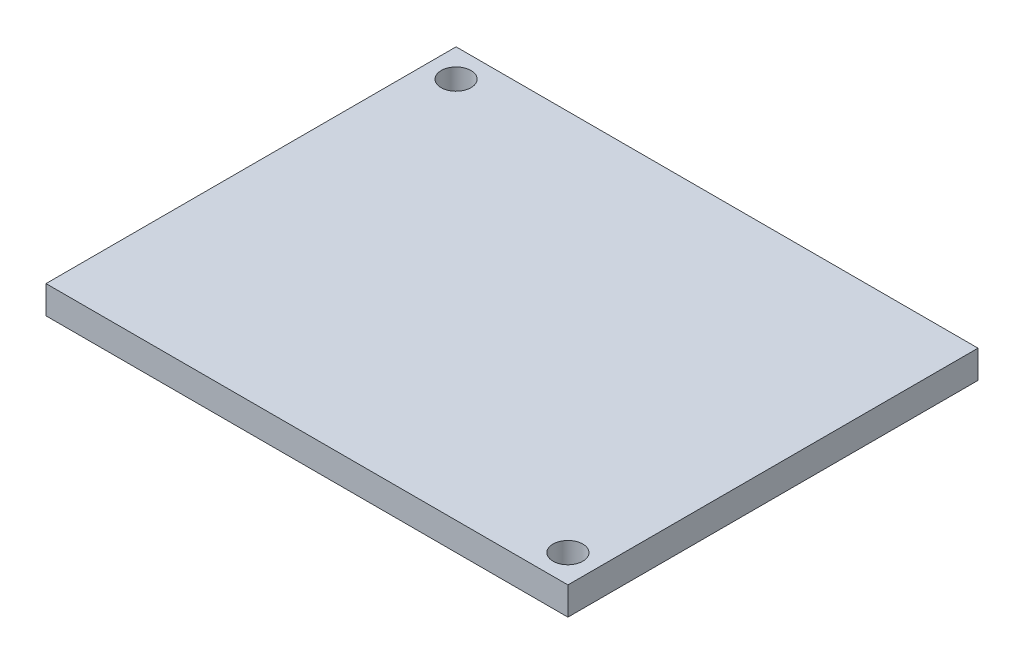
ISO-10303-21;
HEADER;
FILE_DESCRIPTION(('STEP AP214'),'2;1');
FILE_NAME('part.step','',(''),(''),'','','');
FILE_SCHEMA(('AUTOMOTIVE_DESIGN { 1 0 10303 214 1 1 1 1 }'));
ENDSEC;
DATA;
#1=APPLICATION_CONTEXT('core data for automotive mechanical design processes');
#2=APPLICATION_PROTOCOL_DEFINITION('international standard','automotive_design',2000,#1);
#3=PRODUCT_CONTEXT('',#1,'mechanical');
#4=PRODUCT('Part','Part','',(#3));
#5=PRODUCT_RELATED_PRODUCT_CATEGORY('part','',(#4));
#6=PRODUCT_DEFINITION_FORMATION('','',#4);
#7=PRODUCT_DEFINITION_CONTEXT('part definition',#1,'design');
#8=PRODUCT_DEFINITION('design','',#6,#7);
#9=PRODUCT_DEFINITION_SHAPE('','',#8);
#10=(LENGTH_UNIT() NAMED_UNIT(*) SI_UNIT(.MILLI.,.METRE.));
#11=(NAMED_UNIT(*) PLANE_ANGLE_UNIT() SI_UNIT($,.RADIAN.));
#12=(NAMED_UNIT(*) SI_UNIT($,.STERADIAN.) SOLID_ANGLE_UNIT());
#13=UNCERTAINTY_MEASURE_WITH_UNIT(LENGTH_MEASURE(1.E-05),#10,'distance_accuracy_value','');
#14=(GEOMETRIC_REPRESENTATION_CONTEXT(3) GLOBAL_UNCERTAINTY_ASSIGNED_CONTEXT((#13)) GLOBAL_UNIT_ASSIGNED_CONTEXT((#10,
#11,#12)) REPRESENTATION_CONTEXT('',''));
#15=CARTESIAN_POINT('',(0.,0.,0.));
#16=DIRECTION('',(0.,0.,1.));
#17=DIRECTION('',(1.,0.,0.));
#18=AXIS2_PLACEMENT_3D('',#15,#16,#17);
#19=CARTESIAN_POINT('',(-535.449567723343,3.,-356.295389048991));
#20=DIRECTION('',(1.,0.,0.));
#21=DIRECTION('',(0.,0.,-1.));
#22=AXIS2_PLACEMENT_3D('',#19,#20,#21);
#23=PLANE('',#22);
#24=DIRECTION('',(0.,0.,1.));
#25=VECTOR('',#24,1.);
#26=CARTESIAN_POINT('',(-535.449567723343,0.,-356.295389048991));
#27=LINE('',#26,#25);
#28=CARTESIAN_POINT('',(-535.449567723343,0.,-356.295389048991));
#29=VERTEX_POINT('',#28);
#30=CARTESIAN_POINT('',(-535.449567723343,0.,-312.295389048991));
#31=VERTEX_POINT('',#30);
#32=EDGE_CURVE('E96',#29,#31,#27,.T.);
#33=ORIENTED_EDGE('',*,*,#32,.T.);
#34=DIRECTION('',(0.,-1.,0.));
#35=VECTOR('',#34,1.);
#36=CARTESIAN_POINT('',(-535.449567723343,3.,-312.295389048991));
#37=LINE('',#36,#35);
#38=CARTESIAN_POINT('',(-535.449567723343,3.,-312.295389048991));
#39=VERTEX_POINT('',#38);
#40=EDGE_CURVE('E11',#39,#31,#37,.T.);
#41=ORIENTED_EDGE('',*,*,#40,.F.);
#42=DIRECTION('',(0.,0.,1.));
#43=VECTOR('',#42,1.);
#44=CARTESIAN_POINT('',(-535.449567723343,3.,-356.295389048991));
#45=LINE('',#44,#43);
#46=CARTESIAN_POINT('',(-535.449567723343,3.,-356.295389048991));
#47=VERTEX_POINT('',#46);
#48=EDGE_CURVE('E84',#47,#39,#45,.T.);
#49=ORIENTED_EDGE('',*,*,#48,.F.);
#50=DIRECTION('',(0.,-1.,0.));
#51=VECTOR('',#50,1.);
#52=CARTESIAN_POINT('',(-535.449567723343,3.,-356.295389048991));
#53=LINE('',#52,#51);
#54=EDGE_CURVE('E92',#47,#29,#53,.T.);
#55=ORIENTED_EDGE('',*,*,#54,.T.);
#56=EDGE_LOOP('',(#33,#41,#49,#55));
#57=FACE_BOUND('',#56,.T.);
#58=ADVANCED_FACE('F33',(#57),#23,.F.);
#59=CARTESIAN_POINT('',(-535.449567723343,3.,-312.295389048991));
#60=DIRECTION('',(0.,0.,-1.));
#61=DIRECTION('',(-1.,0.,0.));
#62=AXIS2_PLACEMENT_3D('',#59,#60,#61);
#63=PLANE('',#62);
#64=DIRECTION('',(1.,0.,0.));
#65=VECTOR('',#64,1.);
#66=CARTESIAN_POINT('',(-535.449567723343,0.,-312.295389048991));
#67=LINE('',#66,#65);
#68=CARTESIAN_POINT('',(-479.449567723343,0.,-312.295389048991));
#69=VERTEX_POINT('',#68);
#70=EDGE_CURVE('E88',#31,#69,#67,.T.);
#71=ORIENTED_EDGE('',*,*,#70,.T.);
#72=DIRECTION('',(0.,-1.,0.));
#73=VECTOR('',#72,1.);
#74=CARTESIAN_POINT('',(-479.449567723343,3.,-312.295389048991));
#75=LINE('',#74,#73);
#76=CARTESIAN_POINT('',(-479.449567723343,3.,-312.295389048991));
#77=VERTEX_POINT('',#76);
#78=EDGE_CURVE('E41',#77,#69,#75,.T.);
#79=ORIENTED_EDGE('',*,*,#78,.F.);
#80=DIRECTION('',(1.,0.,0.));
#81=VECTOR('',#80,1.);
#82=CARTESIAN_POINT('',(-535.449567723343,3.,-312.295389048991));
#83=LINE('',#82,#81);
#84=EDGE_CURVE('E79',#39,#77,#83,.T.);
#85=ORIENTED_EDGE('',*,*,#84,.F.);
#86=ORIENTED_EDGE('',*,*,#40,.T.);
#87=EDGE_LOOP('',(#71,#79,#85,#86));
#88=FACE_BOUND('',#87,.T.);
#89=ADVANCED_FACE('F87',(#88),#63,.F.);
#90=CARTESIAN_POINT('',(-479.449567723343,3.,-356.295389048991));
#91=DIRECTION('',(-1.,0.,0.));
#92=DIRECTION('',(0.,0.,1.));
#93=AXIS2_PLACEMENT_3D('',#90,#91,#92);
#94=PLANE('',#93);
#95=DIRECTION('',(0.,0.,-1.));
#96=VECTOR('',#95,1.);
#97=CARTESIAN_POINT('',(-479.449567723343,0.,-356.295389048991));
#98=LINE('',#97,#96);
#99=CARTESIAN_POINT('',(-479.449567723343,0.,-356.295389048991));
#100=VERTEX_POINT('',#99);
#101=EDGE_CURVE('E66',#69,#100,#98,.T.);
#102=ORIENTED_EDGE('',*,*,#101,.T.);
#103=DIRECTION('',(0.,-1.,0.));
#104=VECTOR('',#103,1.);
#105=CARTESIAN_POINT('',(-479.449567723343,3.,-356.295389048991));
#106=LINE('',#105,#104);
#107=CARTESIAN_POINT('',(-479.449567723343,3.,-356.295389048991));
#108=VERTEX_POINT('',#107);
#109=EDGE_CURVE('E89',#108,#100,#106,.T.);
#110=ORIENTED_EDGE('',*,*,#109,.F.);
#111=DIRECTION('',(0.,0.,-1.));
#112=VECTOR('',#111,1.);
#113=CARTESIAN_POINT('',(-479.449567723343,3.,-356.295389048991));
#114=LINE('',#113,#112);
#115=EDGE_CURVE('E82',#77,#108,#114,.T.);
#116=ORIENTED_EDGE('',*,*,#115,.F.);
#117=ORIENTED_EDGE('',*,*,#78,.T.);
#118=EDGE_LOOP('',(#102,#110,#116,#117));
#119=FACE_BOUND('',#118,.T.);
#120=ADVANCED_FACE('F90',(#119),#94,.F.);
#121=CARTESIAN_POINT('',(-535.449567723343,3.,-356.295389048991));
#122=DIRECTION('',(0.,0.,1.));
#123=DIRECTION('',(1.,0.,0.));
#124=AXIS2_PLACEMENT_3D('',#121,#122,#123);
#125=PLANE('',#124);
#126=DIRECTION('',(-1.,0.,0.));
#127=VECTOR('',#126,1.);
#128=CARTESIAN_POINT('',(-535.449567723343,0.,-356.295389048991));
#129=LINE('',#128,#127);
#130=EDGE_CURVE('E72',#100,#29,#129,.T.);
#131=ORIENTED_EDGE('',*,*,#130,.T.);
#132=ORIENTED_EDGE('',*,*,#54,.F.);
#133=DIRECTION('',(-1.,0.,0.));
#134=VECTOR('',#133,1.);
#135=CARTESIAN_POINT('',(-535.449567723343,3.,-356.295389048991));
#136=LINE('',#135,#134);
#137=EDGE_CURVE('E49',#108,#47,#136,.T.);
#138=ORIENTED_EDGE('',*,*,#137,.F.);
#139=ORIENTED_EDGE('',*,*,#109,.T.);
#140=EDGE_LOOP('',(#131,#132,#138,#139));
#141=FACE_BOUND('',#140,.T.);
#142=ADVANCED_FACE('F104',(#141),#125,.F.);
#143=CARTESIAN_POINT('',(0.,3.,0.));
#144=DIRECTION('',(0.,1.,0.));
#145=DIRECTION('',(0.,0.,1.));
#146=AXIS2_PLACEMENT_3D('',#143,#144,#145);
#147=PLANE('',#146);
#148=CARTESIAN_POINT('',(-482.449567723343,3.,-315.295389048991));
#149=DIRECTION('',(0.,1.,0.));
#150=DIRECTION('',(0.,0.,1.));
#151=AXIS2_PLACEMENT_3D('',#148,#149,#150);
#152=CIRCLE('',#151,1.59999999999996);
#153=CARTESIAN_POINT('',(-482.449567723343,3.,-313.695389048991));
#154=VERTEX_POINT('',#153);
#155=EDGE_CURVE('E116',#154,#154,#152,.T.);
#156=ORIENTED_EDGE('',*,*,#155,.F.);
#157=EDGE_LOOP('',(#156));
#158=FACE_BOUND('',#157,.T.);
#159=CARTESIAN_POINT('',(-532.449567723343,3.,-353.295389048991));
#160=DIRECTION('',(0.,1.,0.));
#161=DIRECTION('',(0.,0.,1.));
#162=AXIS2_PLACEMENT_3D('',#159,#160,#161);
#163=CIRCLE('',#162,1.60000000000002);
#164=CARTESIAN_POINT('',(-532.449567723343,3.,-351.695389048991));
#165=VERTEX_POINT('',#164);
#166=EDGE_CURVE('E110',#165,#165,#163,.T.);
#167=ORIENTED_EDGE('',*,*,#166,.F.);
#168=EDGE_LOOP('',(#167));
#169=FACE_BOUND('',#168,.T.);
#170=ORIENTED_EDGE('',*,*,#48,.T.);
#171=ORIENTED_EDGE('',*,*,#84,.T.);
#172=ORIENTED_EDGE('',*,*,#115,.T.);
#173=ORIENTED_EDGE('',*,*,#137,.T.);
#174=EDGE_LOOP('',(#170,#171,#172,#173));
#175=FACE_BOUND('',#174,.T.);
#176=ADVANCED_FACE('F80',(#158,#169,#175),#147,.T.);
#177=CARTESIAN_POINT('',(0.,0.,0.));
#178=DIRECTION('',(0.,1.,0.));
#179=DIRECTION('',(0.,0.,1.));
#180=AXIS2_PLACEMENT_3D('',#177,#178,#179);
#181=PLANE('',#180);
#182=CARTESIAN_POINT('',(-482.449567723343,0.,-315.295389048991));
#183=DIRECTION('',(0.,1.,0.));
#184=DIRECTION('',(0.,0.,1.));
#185=AXIS2_PLACEMENT_3D('',#182,#183,#184);
#186=CIRCLE('',#185,1.59999999999996);
#187=CARTESIAN_POINT('',(-482.449567723343,0.,-313.695389048991));
#188=VERTEX_POINT('',#187);
#189=EDGE_CURVE('E113',#188,#188,#186,.T.);
#190=ORIENTED_EDGE('',*,*,#189,.T.);
#191=EDGE_LOOP('',(#190));
#192=FACE_BOUND('',#191,.T.);
#193=CARTESIAN_POINT('',(-532.449567723343,0.,-353.295389048991));
#194=DIRECTION('',(0.,1.,0.));
#195=DIRECTION('',(0.,0.,1.));
#196=AXIS2_PLACEMENT_3D('',#193,#194,#195);
#197=CIRCLE('',#196,1.60000000000002);
#198=CARTESIAN_POINT('',(-532.449567723343,0.,-351.695389048991));
#199=VERTEX_POINT('',#198);
#200=EDGE_CURVE('E99',#199,#199,#197,.T.);
#201=ORIENTED_EDGE('',*,*,#200,.T.);
#202=EDGE_LOOP('',(#201));
#203=FACE_BOUND('',#202,.T.);
#204=ORIENTED_EDGE('',*,*,#32,.F.);
#205=ORIENTED_EDGE('',*,*,#130,.F.);
#206=ORIENTED_EDGE('',*,*,#101,.F.);
#207=ORIENTED_EDGE('',*,*,#70,.F.);
#208=EDGE_LOOP('',(#204,#205,#206,#207));
#209=FACE_BOUND('',#208,.T.);
#210=ADVANCED_FACE('F107',(#192,#203,#209),#181,.F.);
#211=CARTESIAN_POINT('',(-532.449567723343,0.,-353.295389048991));
#212=DIRECTION('',(0.,1.,0.));
#213=DIRECTION('',(0.,0.,1.));
#214=AXIS2_PLACEMENT_3D('',#211,#212,#213);
#215=CYLINDRICAL_SURFACE('',#214,1.60000000000002);
#216=ORIENTED_EDGE('',*,*,#200,.F.);
#217=EDGE_LOOP('',(#216));
#218=FACE_BOUND('',#217,.T.);
#219=ORIENTED_EDGE('',*,*,#166,.T.);
#220=EDGE_LOOP('',(#219));
#221=FACE_BOUND('',#220,.T.);
#222=ADVANCED_FACE('F127',(#218,#221),#215,.F.);
#223=CARTESIAN_POINT('',(-482.449567723343,0.,-315.295389048991));
#224=DIRECTION('',(0.,1.,0.));
#225=DIRECTION('',(0.,0.,1.));
#226=AXIS2_PLACEMENT_3D('',#223,#224,#225);
#227=CYLINDRICAL_SURFACE('',#226,1.59999999999996);
#228=ORIENTED_EDGE('',*,*,#189,.F.);
#229=EDGE_LOOP('',(#228));
#230=FACE_BOUND('',#229,.T.);
#231=ORIENTED_EDGE('',*,*,#155,.T.);
#232=EDGE_LOOP('',(#231));
#233=FACE_BOUND('',#232,.T.);
#234=ADVANCED_FACE('F124',(#230,#233),#227,.F.);
#235=CLOSED_SHELL('',(#58,#89,#120,#142,#176,#210,#222,#234));
#236=MANIFOLD_SOLID_BREP('B2',#235);
#237=ADVANCED_BREP_SHAPE_REPRESENTATION('',(#18,#236),#14);
#238=SHAPE_DEFINITION_REPRESENTATION(#9,#237);
ENDSEC;
END-ISO-10303-21;
